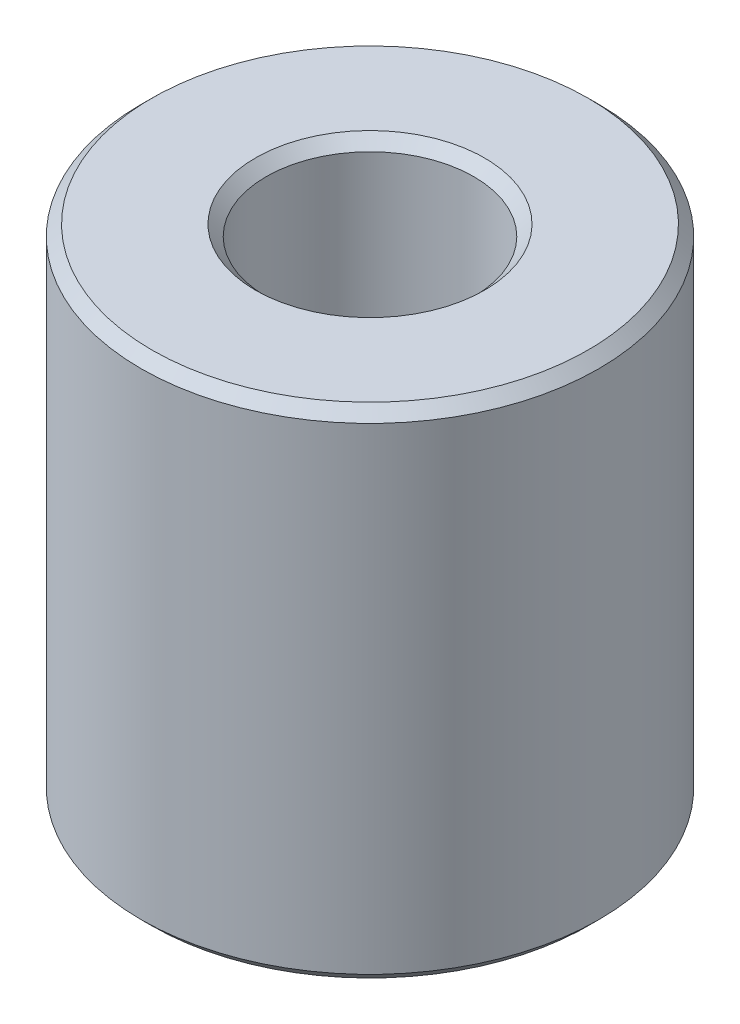
ISO-10303-21;
HEADER;
FILE_DESCRIPTION(('STEP AP214'),'2;1');
FILE_NAME('part.step','',(''),(''),'','','');
FILE_SCHEMA(('AUTOMOTIVE_DESIGN { 1 0 10303 214 1 1 1 1 }'));
ENDSEC;
DATA;
#1=APPLICATION_CONTEXT('core data for automotive mechanical design processes');
#2=APPLICATION_PROTOCOL_DEFINITION('international standard','automotive_design',2000,#1);
#3=PRODUCT_CONTEXT('',#1,'mechanical');
#4=PRODUCT('Part','Part','',(#3));
#5=PRODUCT_RELATED_PRODUCT_CATEGORY('part','',(#4));
#6=PRODUCT_DEFINITION_FORMATION('','',#4);
#7=PRODUCT_DEFINITION_CONTEXT('part definition',#1,'design');
#8=PRODUCT_DEFINITION('design','',#6,#7);
#9=PRODUCT_DEFINITION_SHAPE('','',#8);
#10=(LENGTH_UNIT() NAMED_UNIT(*) SI_UNIT(.MILLI.,.METRE.));
#11=(NAMED_UNIT(*) PLANE_ANGLE_UNIT() SI_UNIT($,.RADIAN.));
#12=(NAMED_UNIT(*) SI_UNIT($,.STERADIAN.) SOLID_ANGLE_UNIT());
#13=UNCERTAINTY_MEASURE_WITH_UNIT(LENGTH_MEASURE(1.E-05),#10,'distance_accuracy_value','');
#14=(GEOMETRIC_REPRESENTATION_CONTEXT(3) GLOBAL_UNCERTAINTY_ASSIGNED_CONTEXT((#13)) GLOBAL_UNIT_ASSIGNED_CONTEXT((#10,
#11,#12)) REPRESENTATION_CONTEXT('',''));
#15=CARTESIAN_POINT('',(0.,0.,0.));
#16=DIRECTION('',(0.,0.,1.));
#17=DIRECTION('',(1.,0.,0.));
#18=AXIS2_PLACEMENT_3D('',#15,#16,#17);
#19=CARTESIAN_POINT('',(0.,54.462744785059,0.));
#20=DIRECTION('',(0.,-1.,0.));
#21=DIRECTION('',(0.,0.,-1.));
#22=AXIS2_PLACEMENT_3D('',#19,#20,#21);
#23=CYLINDRICAL_SURFACE('',#22,25.);
#24=CARTESIAN_POINT('',(0.,1.1769514484643,0.));
#25=DIRECTION('',(0.,1.,0.));
#26=DIRECTION('',(0.,0.,1.));
#27=AXIS2_PLACEMENT_3D('',#24,#25,#26);
#28=CIRCLE('',#27,25.);
#29=CARTESIAN_POINT('',(0.,1.1769514484643,25.));
#30=VERTEX_POINT('',#29);
#31=EDGE_CURVE('E10',#30,#30,#28,.T.);
#32=ORIENTED_EDGE('',*,*,#31,.T.);
#33=EDGE_LOOP('',(#32));
#34=FACE_BOUND('',#33,.T.);
#35=CARTESIAN_POINT('',(0.,53.2857933365947,0.));
#36=DIRECTION('',(0.,1.,0.));
#37=DIRECTION('',(0.,0.,1.));
#38=AXIS2_PLACEMENT_3D('',#35,#36,#37);
#39=CIRCLE('',#38,25.);
#40=CARTESIAN_POINT('',(0.,53.2857933365947,25.));
#41=VERTEX_POINT('',#40);
#42=EDGE_CURVE('E50',#41,#41,#39,.F.);
#43=ORIENTED_EDGE('',*,*,#42,.T.);
#44=EDGE_LOOP('',(#43));
#45=FACE_BOUND('',#44,.T.);
#46=ADVANCED_FACE('F39',(#34,#45),#23,.T.);
#47=CARTESIAN_POINT('',(0.,54.462744785059,0.));
#48=DIRECTION('',(0.,1.,0.));
#49=DIRECTION('',(0.,0.,1.));
#50=AXIS2_PLACEMENT_3D('',#47,#48,#49);
#51=PLANE('',#50);
#52=CARTESIAN_POINT('',(0.,54.462744785059,0.));
#53=DIRECTION('',(0.,1.,0.));
#54=DIRECTION('',(0.,0.,1.));
#55=AXIS2_PLACEMENT_3D('',#52,#53,#54);
#56=CIRCLE('',#55,12.5150877441914);
#57=CARTESIAN_POINT('',(0.,54.462744785059,12.5150877441914));
#58=VERTEX_POINT('',#57);
#59=EDGE_CURVE('E58',#58,#58,#56,.F.);
#60=ORIENTED_EDGE('',*,*,#59,.T.);
#61=EDGE_LOOP('',(#60));
#62=FACE_BOUND('',#61,.T.);
#63=CARTESIAN_POINT('',(0.,54.462744785059,0.));
#64=DIRECTION('',(0.,1.,0.));
#65=DIRECTION('',(0.,0.,1.));
#66=AXIS2_PLACEMENT_3D('',#63,#64,#65);
#67=CIRCLE('',#66,23.8230485515357);
#68=CARTESIAN_POINT('',(0.,54.462744785059,23.8230485515357));
#69=VERTEX_POINT('',#68);
#70=EDGE_CURVE('E61',#69,#69,#67,.T.);
#71=ORIENTED_EDGE('',*,*,#70,.T.);
#72=EDGE_LOOP('',(#71));
#73=FACE_BOUND('',#72,.T.);
#74=ADVANCED_FACE('F88',(#62,#73),#51,.T.);
#75=CARTESIAN_POINT('',(0.,0.,0.));
#76=DIRECTION('',(0.,1.,0.));
#77=DIRECTION('',(0.,0.,1.));
#78=AXIS2_PLACEMENT_3D('',#75,#76,#77);
#79=PLANE('',#78);
#80=CARTESIAN_POINT('',(0.,0.,0.));
#81=DIRECTION('',(0.,1.,0.));
#82=DIRECTION('',(0.,0.,1.));
#83=AXIS2_PLACEMENT_3D('',#80,#81,#82);
#84=CIRCLE('',#83,12.5150877441914);
#85=CARTESIAN_POINT('',(0.,0.,12.5150877441914));
#86=VERTEX_POINT('',#85);
#87=EDGE_CURVE('E51',#86,#86,#84,.T.);
#88=ORIENTED_EDGE('',*,*,#87,.T.);
#89=EDGE_LOOP('',(#88));
#90=FACE_BOUND('',#89,.T.);
#91=CARTESIAN_POINT('',(0.,0.,0.));
#92=DIRECTION('',(0.,1.,0.));
#93=DIRECTION('',(0.,0.,1.));
#94=AXIS2_PLACEMENT_3D('',#91,#92,#93);
#95=CIRCLE('',#94,23.8230485515357);
#96=CARTESIAN_POINT('',(0.,0.,23.8230485515357));
#97=VERTEX_POINT('',#96);
#98=EDGE_CURVE('E54',#97,#97,#95,.F.);
#99=ORIENTED_EDGE('',*,*,#98,.T.);
#100=EDGE_LOOP('',(#99));
#101=FACE_BOUND('',#100,.T.);
#102=ADVANCED_FACE('F83',(#90,#101),#79,.F.);
#103=CARTESIAN_POINT('',(0.,54.462744785059,0.));
#104=DIRECTION('',(0.,-1.,0.));
#105=DIRECTION('',(0.,0.,-1.));
#106=AXIS2_PLACEMENT_3D('',#103,#104,#105);
#107=CYLINDRICAL_SURFACE('',#106,11.3381362957271);
#108=CARTESIAN_POINT('',(0.,53.2857933365947,0.));
#109=DIRECTION('',(0.,1.,0.));
#110=DIRECTION('',(0.,0.,1.));
#111=AXIS2_PLACEMENT_3D('',#108,#109,#110);
#112=CIRCLE('',#111,11.3381362957271);
#113=CARTESIAN_POINT('',(0.,53.2857933365947,11.3381362957271));
#114=VERTEX_POINT('',#113);
#115=EDGE_CURVE('E67',#114,#114,#112,.T.);
#116=ORIENTED_EDGE('',*,*,#115,.T.);
#117=EDGE_LOOP('',(#116));
#118=FACE_BOUND('',#117,.T.);
#119=CARTESIAN_POINT('',(0.,1.1769514484643,0.));
#120=DIRECTION('',(0.,1.,0.));
#121=DIRECTION('',(0.,0.,1.));
#122=AXIS2_PLACEMENT_3D('',#119,#120,#121);
#123=CIRCLE('',#122,11.3381362957271);
#124=CARTESIAN_POINT('',(0.,1.1769514484643,11.3381362957271));
#125=VERTEX_POINT('',#124);
#126=EDGE_CURVE('E69',#125,#125,#123,.F.);
#127=ORIENTED_EDGE('',*,*,#126,.T.);
#128=EDGE_LOOP('',(#127));
#129=FACE_BOUND('',#128,.T.);
#130=ADVANCED_FACE('F71',(#118,#129),#107,.F.);
#131=CARTESIAN_POINT('',(0.,53.2857933365947,0.));
#132=DIRECTION('',(0.,1.,0.));
#133=DIRECTION('',(0.,0.,1.));
#134=AXIS2_PLACEMENT_3D('',#131,#132,#133);
#135=CONICAL_SURFACE('',#134,11.3381362957271,0.785398163397456);
#136=ORIENTED_EDGE('',*,*,#59,.F.);
#137=EDGE_LOOP('',(#136));
#138=FACE_BOUND('',#137,.T.);
#139=ORIENTED_EDGE('',*,*,#115,.F.);
#140=EDGE_LOOP('',(#139));
#141=FACE_BOUND('',#140,.T.);
#142=ADVANCED_FACE('F77',(#138,#141),#135,.F.);
#143=CARTESIAN_POINT('',(0.,0.,0.));
#144=DIRECTION('',(0.,-1.,0.));
#145=DIRECTION('',(0.,0.,-1.));
#146=AXIS2_PLACEMENT_3D('',#143,#144,#145);
#147=CONICAL_SURFACE('',#146,12.5150877441914,0.785398163397442);
#148=ORIENTED_EDGE('',*,*,#126,.F.);
#149=EDGE_LOOP('',(#148));
#150=FACE_BOUND('',#149,.T.);
#151=ORIENTED_EDGE('',*,*,#87,.F.);
#152=EDGE_LOOP('',(#151));
#153=FACE_BOUND('',#152,.T.);
#154=ADVANCED_FACE('F73',(#150,#153),#147,.F.);
#155=CARTESIAN_POINT('',(0.,1.1769514484643,0.));
#156=DIRECTION('',(0.,1.,0.));
#157=DIRECTION('',(0.,0.,1.));
#158=AXIS2_PLACEMENT_3D('',#155,#156,#157);
#159=CONICAL_SURFACE('',#158,25.,0.785398163397447);
#160=ORIENTED_EDGE('',*,*,#98,.F.);
#161=EDGE_LOOP('',(#160));
#162=FACE_BOUND('',#161,.T.);
#163=ORIENTED_EDGE('',*,*,#31,.F.);
#164=EDGE_LOOP('',(#163));
#165=FACE_BOUND('',#164,.T.);
#166=ADVANCED_FACE('F76',(#162,#165),#159,.T.);
#167=CARTESIAN_POINT('',(0.,54.462744785059,0.));
#168=DIRECTION('',(0.,-1.,0.));
#169=DIRECTION('',(0.,0.,-1.));
#170=AXIS2_PLACEMENT_3D('',#167,#168,#169);
#171=CONICAL_SURFACE('',#170,23.8230485515357,0.785398163397445);
#172=ORIENTED_EDGE('',*,*,#42,.F.);
#173=EDGE_LOOP('',(#172));
#174=FACE_BOUND('',#173,.T.);
#175=ORIENTED_EDGE('',*,*,#70,.F.);
#176=EDGE_LOOP('',(#175));
#177=FACE_BOUND('',#176,.T.);
#178=ADVANCED_FACE('F45',(#174,#177),#171,.T.);
#179=CLOSED_SHELL('',(#46,#74,#102,#130,#142,#154,#166,#178));
#180=MANIFOLD_SOLID_BREP('B2',#179);
#181=ADVANCED_BREP_SHAPE_REPRESENTATION('',(#18,#180),#14);
#182=SHAPE_DEFINITION_REPRESENTATION(#9,#181);
ENDSEC;
END-ISO-10303-21;
